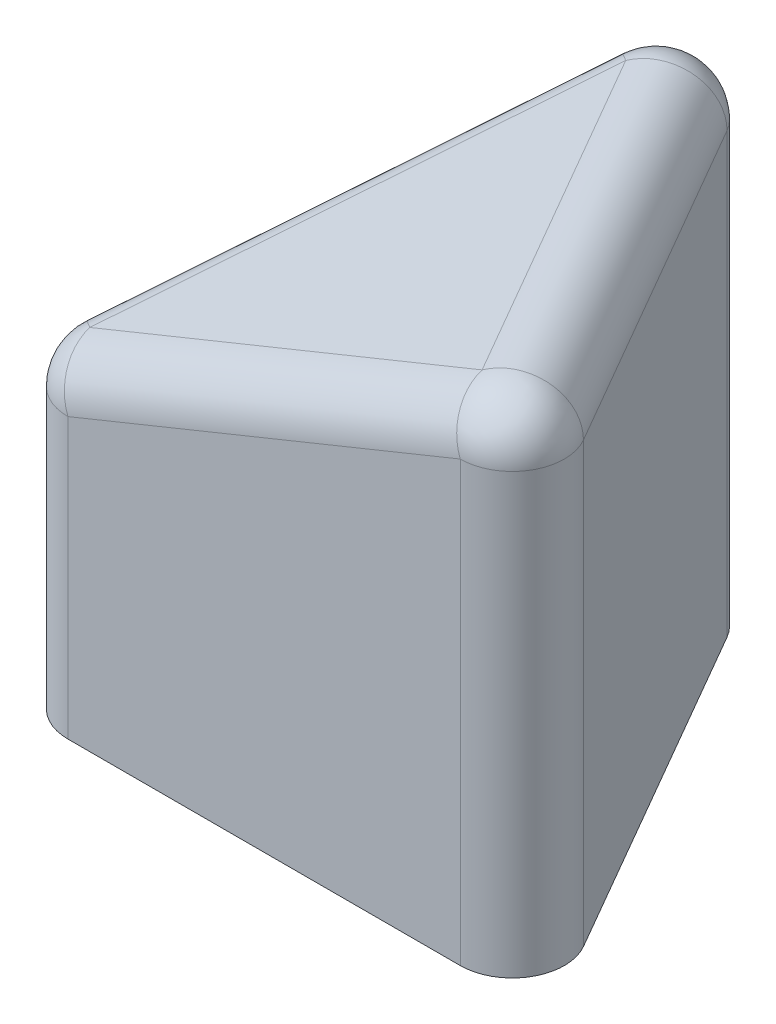
ISO-10303-21;
HEADER;
FILE_DESCRIPTION(('STEP AP214'),'2;1');
FILE_NAME('part.step','',(''),(''),'','','');
FILE_SCHEMA(('AUTOMOTIVE_DESIGN { 1 0 10303 214 1 1 1 1 }'));
ENDSEC;
DATA;
#1=APPLICATION_CONTEXT('core data for automotive mechanical design processes');
#2=APPLICATION_PROTOCOL_DEFINITION('international standard','automotive_design',2000,#1);
#3=PRODUCT_CONTEXT('',#1,'mechanical');
#4=PRODUCT('Part','Part','',(#3));
#5=PRODUCT_RELATED_PRODUCT_CATEGORY('part','',(#4));
#6=PRODUCT_DEFINITION_FORMATION('','',#4);
#7=PRODUCT_DEFINITION_CONTEXT('part definition',#1,'design');
#8=PRODUCT_DEFINITION('design','',#6,#7);
#9=PRODUCT_DEFINITION_SHAPE('','',#8);
#10=(LENGTH_UNIT() NAMED_UNIT(*) SI_UNIT(.MILLI.,.METRE.));
#11=(NAMED_UNIT(*) PLANE_ANGLE_UNIT() SI_UNIT($,.RADIAN.));
#12=(NAMED_UNIT(*) SI_UNIT($,.STERADIAN.) SOLID_ANGLE_UNIT());
#13=UNCERTAINTY_MEASURE_WITH_UNIT(LENGTH_MEASURE(1.E-05),#10,'distance_accuracy_value','');
#14=(GEOMETRIC_REPRESENTATION_CONTEXT(3) GLOBAL_UNCERTAINTY_ASSIGNED_CONTEXT((#13)) GLOBAL_UNIT_ASSIGNED_CONTEXT((#10,
#11,#12)) REPRESENTATION_CONTEXT('',''));
#15=CARTESIAN_POINT('',(0.,0.,0.));
#16=DIRECTION('',(0.,0.,1.));
#17=DIRECTION('',(1.,0.,0.));
#18=AXIS2_PLACEMENT_3D('',#15,#16,#17);
#19=CARTESIAN_POINT('',(9.26794919243112,10.,-1.));
#20=DIRECTION('',(0.,-1.,0.));
#21=DIRECTION('',(0.,0.,-1.));
#22=AXIS2_PLACEMENT_3D('',#19,#20,#21);
#23=CYLINDRICAL_SURFACE('',#22,1.);
#24=DIRECTION('',(0.,-1.,0.));
#25=VECTOR('',#24,1.);
#26=CARTESIAN_POINT('',(10.1339745962156,10.,-1.50000000000001));
#27=LINE('',#26,#25);
#28=CARTESIAN_POINT('',(10.1339745962156,8.4262852298518,-1.50000000000001));
#29=VERTEX_POINT('',#28);
#30=CARTESIAN_POINT('',(10.1339745962156,0.,-1.50000000000001));
#31=VERTEX_POINT('',#30);
#32=EDGE_CURVE('E95',#29,#31,#27,.T.);
#33=ORIENTED_EDGE('',*,*,#32,.F.);
#34=CARTESIAN_POINT('',(9.26794919243112,8.4262852298518,-1.));
#35=DIRECTION('',(0.,-1.,0.));
#36=DIRECTION('',(0.,0.,-1.));
#37=AXIS2_PLACEMENT_3D('',#34,#35,#36);
#38=CIRCLE('',#37,1.);
#39=CARTESIAN_POINT('',(9.26794919243111,8.4262852298518,0.));
#40=VERTEX_POINT('',#39);
#41=EDGE_CURVE('E152',#29,#40,#38,.T.);
#42=ORIENTED_EDGE('',*,*,#41,.T.);
#43=DIRECTION('',(0.,-1.,0.));
#44=VECTOR('',#43,1.);
#45=CARTESIAN_POINT('',(9.26794919243111,10.,0.));
#46=LINE('',#45,#44);
#47=CARTESIAN_POINT('',(9.26794919243111,0.,0.));
#48=VERTEX_POINT('',#47);
#49=EDGE_CURVE('E118',#40,#48,#46,.T.);
#50=ORIENTED_EDGE('',*,*,#49,.T.);
#51=CARTESIAN_POINT('',(9.26794919243112,0.,-1.));
#52=DIRECTION('',(0.,1.,0.));
#53=DIRECTION('',(0.,0.,1.));
#54=AXIS2_PLACEMENT_3D('',#51,#52,#53);
#55=CIRCLE('',#54,1.);
#56=EDGE_CURVE('E112',#48,#31,#55,.T.);
#57=ORIENTED_EDGE('',*,*,#56,.T.);
#58=EDGE_LOOP('',(#33,#42,#50,#57));
#59=FACE_BOUND('',#58,.T.);
#60=ADVANCED_FACE('F33',(#59),#23,.T.);
#61=CARTESIAN_POINT('',(10.1339745962156,10.,-1.50000000000001));
#62=DIRECTION('',(-0.866025403784439,0.,0.5));
#63=DIRECTION('',(0.5,0.,0.866025403784439));
#64=AXIS2_PLACEMENT_3D('',#61,#62,#63);
#65=PLANE('',#64);
#66=DIRECTION('',(0.,-1.,0.));
#67=VECTOR('',#66,1.);
#68=CARTESIAN_POINT('',(6.36602540378444,10.,-8.02627944162881));
#69=LINE('',#68,#67);
#70=CARTESIAN_POINT('',(6.36602540378444,8.4262852298518,-8.02627944162881));
#71=VERTEX_POINT('',#70);
#72=CARTESIAN_POINT('',(6.36602540378444,0.,-8.02627944162881));
#73=VERTEX_POINT('',#72);
#74=EDGE_CURVE('E106',#71,#73,#69,.T.);
#75=ORIENTED_EDGE('',*,*,#74,.F.);
#76=DIRECTION('',(-0.5,0.,-0.866025403784439));
#77=VECTOR('',#76,1.);
#78=CARTESIAN_POINT('',(10.1339745962156,8.4262852298518,-1.50000000000001));
#79=LINE('',#78,#77);
#80=EDGE_CURVE('E101',#71,#29,#79,.F.);
#81=ORIENTED_EDGE('',*,*,#80,.T.);
#82=ORIENTED_EDGE('',*,*,#32,.T.);
#83=DIRECTION('',(-0.5,0.,-0.866025403784438));
#84=VECTOR('',#83,1.);
#85=CARTESIAN_POINT('',(10.1339745962156,0.,-1.50000000000001));
#86=LINE('',#85,#84);
#87=EDGE_CURVE('E98',#31,#73,#86,.T.);
#88=ORIENTED_EDGE('',*,*,#87,.T.);
#89=EDGE_LOOP('',(#75,#81,#82,#88));
#90=FACE_BOUND('',#89,.T.);
#91=ADVANCED_FACE('F97',(#90),#65,.F.);
#92=CARTESIAN_POINT('',(5.5,10.,-7.52627944162882));
#93=DIRECTION('',(0.,-1.,0.));
#94=DIRECTION('',(0.,0.,-1.));
#95=AXIS2_PLACEMENT_3D('',#92,#93,#94);
#96=CYLINDRICAL_SURFACE('',#95,1.);
#97=DIRECTION('',(0.,-1.,0.));
#98=VECTOR('',#97,1.);
#99=CARTESIAN_POINT('',(4.63397459621556,10.,-8.02627944162881));
#100=LINE('',#99,#98);
#101=CARTESIAN_POINT('',(4.63397459621556,8.42628522985179,-8.02627944162881));
#102=VERTEX_POINT('',#101);
#103=CARTESIAN_POINT('',(4.63397459621556,0.,-8.02627944162881));
#104=VERTEX_POINT('',#103);
#105=EDGE_CURVE('E138',#102,#104,#100,.T.);
#106=ORIENTED_EDGE('',*,*,#105,.F.);
#107=CARTESIAN_POINT('',(5.5,8.4262852298518,-7.52627944162882));
#108=DIRECTION('',(0.,-1.,0.));
#109=DIRECTION('',(0.,0.,-1.));
#110=AXIS2_PLACEMENT_3D('',#107,#108,#109);
#111=CIRCLE('',#110,1.);
#112=EDGE_CURVE('E42',#102,#71,#111,.T.);
#113=ORIENTED_EDGE('',*,*,#112,.T.);
#114=ORIENTED_EDGE('',*,*,#74,.T.);
#115=CARTESIAN_POINT('',(5.5,0.,-7.52627944162882));
#116=DIRECTION('',(0.,1.,0.));
#117=DIRECTION('',(0.,0.,1.));
#118=AXIS2_PLACEMENT_3D('',#115,#116,#117);
#119=CIRCLE('',#118,1.);
#120=EDGE_CURVE('E115',#73,#104,#119,.T.);
#121=ORIENTED_EDGE('',*,*,#120,.T.);
#122=EDGE_LOOP('',(#106,#113,#114,#121));
#123=FACE_BOUND('',#122,.T.);
#124=ADVANCED_FACE('F187',(#123),#96,.T.);
#125=CARTESIAN_POINT('',(4.63397459621556,10.,-8.02627944162881));
#126=DIRECTION('',(0.866025403784439,0.,0.5));
#127=DIRECTION('',(0.5,0.,-0.866025403784439));
#128=AXIS2_PLACEMENT_3D('',#125,#126,#127);
#129=PLANE('',#128);
#130=DIRECTION('',(0.,-1.,0.));
#131=VECTOR('',#130,1.);
#132=CARTESIAN_POINT('',(0.866025403784446,10.,-1.50000000000001));
#133=LINE('',#132,#131);
#134=CARTESIAN_POINT('',(0.866025403784446,5.36456083467666,-1.50000000000001));
#135=VERTEX_POINT('',#134);
#136=CARTESIAN_POINT('',(0.866025403784446,0.,-1.50000000000001));
#137=VERTEX_POINT('',#136);
#138=EDGE_CURVE('E136',#135,#137,#133,.T.);
#139=ORIENTED_EDGE('',*,*,#138,.F.);
#140=DIRECTION('',(0.463227593724074,0.37640508186051,-0.80233372779797));
#141=VECTOR('',#140,1.);
#142=CARTESIAN_POINT('',(4.908369423999,8.64925037487606,-8.50154522468386));
#143=LINE('',#142,#141);
#144=EDGE_CURVE('E11',#135,#102,#143,.T.);
#145=ORIENTED_EDGE('',*,*,#144,.T.);
#146=ORIENTED_EDGE('',*,*,#105,.T.);
#147=DIRECTION('',(-0.5,0.,0.866025403784438));
#148=VECTOR('',#147,1.);
#149=CARTESIAN_POINT('',(4.63397459621556,0.,-8.02627944162881));
#150=LINE('',#149,#148);
#151=EDGE_CURVE('E125',#104,#137,#150,.T.);
#152=ORIENTED_EDGE('',*,*,#151,.T.);
#153=EDGE_LOOP('',(#139,#145,#146,#152));
#154=FACE_BOUND('',#153,.T.);
#155=ADVANCED_FACE('F186',(#154),#129,.F.);
#156=CARTESIAN_POINT('',(1.73205080756888,10.,-1.));
#157=DIRECTION('',(0.,-1.,0.));
#158=DIRECTION('',(0.,0.,-1.));
#159=AXIS2_PLACEMENT_3D('',#156,#157,#158);
#160=CYLINDRICAL_SURFACE('',#159,1.);
#161=DIRECTION('',(0.,-1.,0.));
#162=VECTOR('',#161,1.);
#163=CARTESIAN_POINT('',(1.73205080756889,10.,0.));
#164=LINE('',#163,#162);
#165=CARTESIAN_POINT('',(1.73205080756889,5.36456083467666,0.));
#166=VERTEX_POINT('',#165);
#167=CARTESIAN_POINT('',(1.73205080756889,0.,0.));
#168=VERTEX_POINT('',#167);
#169=EDGE_CURVE('E134',#166,#168,#164,.T.);
#170=ORIENTED_EDGE('',*,*,#169,.F.);
#171=CARTESIAN_POINT('',(1.73205080756888,5.36456083467665,-1.));
#172=DIRECTION('',(0.,-1.,0.));
#173=DIRECTION('',(0.,0.,-1.));
#174=AXIS2_PLACEMENT_3D('',#171,#172,#173);
#175=CIRCLE('',#174,1.);
#176=EDGE_CURVE('E105',#166,#135,#175,.T.);
#177=ORIENTED_EDGE('',*,*,#176,.T.);
#178=ORIENTED_EDGE('',*,*,#138,.T.);
#179=CARTESIAN_POINT('',(1.73205080756888,0.,-1.));
#180=DIRECTION('',(0.,1.,0.));
#181=DIRECTION('',(0.,0.,1.));
#182=AXIS2_PLACEMENT_3D('',#179,#180,#181);
#183=CIRCLE('',#182,1.);
#184=EDGE_CURVE('E128',#137,#168,#183,.T.);
#185=ORIENTED_EDGE('',*,*,#184,.T.);
#186=EDGE_LOOP('',(#170,#177,#178,#185));
#187=FACE_BOUND('',#186,.T.);
#188=ADVANCED_FACE('F183',(#187),#160,.T.);
#189=CARTESIAN_POINT('',(1.73205080756889,10.,0.));
#190=DIRECTION('',(0.,0.,-1.));
#191=DIRECTION('',(-1.,0.,0.));
#192=AXIS2_PLACEMENT_3D('',#189,#190,#191);
#193=PLANE('',#192);
#194=ORIENTED_EDGE('',*,*,#49,.F.);
#195=DIRECTION('',(-0.926455187448148,-0.37640508186051,0.));
#196=VECTOR('',#195,1.);
#197=CARTESIAN_POINT('',(3.34853246688477,6.02131349745438,0.));
#198=LINE('',#197,#196);
#199=EDGE_CURVE('E143',#40,#166,#198,.T.);
#200=ORIENTED_EDGE('',*,*,#199,.T.);
#201=ORIENTED_EDGE('',*,*,#169,.T.);
#202=DIRECTION('',(1.,0.,0.));
#203=VECTOR('',#202,1.);
#204=CARTESIAN_POINT('',(1.73205080756889,0.,0.));
#205=LINE('',#204,#203);
#206=EDGE_CURVE('E131',#168,#48,#205,.T.);
#207=ORIENTED_EDGE('',*,*,#206,.T.);
#208=EDGE_LOOP('',(#194,#200,#201,#207));
#209=FACE_BOUND('',#208,.T.);
#210=ADVANCED_FACE('F179',(#209),#193,.F.);
#211=CARTESIAN_POINT('',(9.26794919243112,0.,-1.));
#212=DIRECTION('',(0.,1.,0.));
#213=DIRECTION('',(0.,0.,1.));
#214=AXIS2_PLACEMENT_3D('',#211,#212,#213);
#215=PLANE('',#214);
#216=ORIENTED_EDGE('',*,*,#56,.F.);
#217=ORIENTED_EDGE('',*,*,#206,.F.);
#218=ORIENTED_EDGE('',*,*,#184,.F.);
#219=ORIENTED_EDGE('',*,*,#151,.F.);
#220=ORIENTED_EDGE('',*,*,#120,.F.);
#221=ORIENTED_EDGE('',*,*,#87,.F.);
#222=EDGE_LOOP('',(#216,#217,#218,#219,#220,#221));
#223=FACE_BOUND('',#222,.T.);
#224=ADVANCED_FACE('F110',(#223),#215,.F.);
#225=CARTESIAN_POINT('',(16.75,10.,9.95929214352105));
#226=DIRECTION('',(0.367819777735899,-0.905323964929177,-0.212360847689089));
#227=DIRECTION('',(0.926455187448148,0.37640508186051,0.));
#228=AXIS2_PLACEMENT_3D('',#225,#226,#227);
#229=PLANE('',#228);
#230=DIRECTION('',(0.463227593724074,0.37640508186051,-0.80233372779797));
#231=VECTOR('',#230,1.);
#232=CARTESIAN_POINT('',(1.32185571351418,6.23545186723319,-0.714242951459956));
#233=LINE('',#232,#231);
#234=CARTESIAN_POINT('',(5.1321802222641,9.33160919478097,-7.31391859393974));
#235=VERTEX_POINT('',#234);
#236=CARTESIAN_POINT('',(1.36423102983298,6.26988479960583,-0.787639152310912));
#237=VERTEX_POINT('',#236);
#238=EDGE_CURVE('E145',#235,#237,#233,.F.);
#239=ORIENTED_EDGE('',*,*,#238,.T.);
#240=DIRECTION('',(-0.926455187448148,-0.37640508186051,0.));
#241=VECTOR('',#240,1.);
#242=CARTESIAN_POINT('',(15.8709070411383,12.1637333586489,-0.787639152310914));
#243=LINE('',#242,#241);
#244=CARTESIAN_POINT('',(8.90012941469522,9.33160919478097,-0.787639152310911));
#245=VERTEX_POINT('',#244);
#246=EDGE_CURVE('E149',#237,#245,#243,.F.);
#247=ORIENTED_EDGE('',*,*,#246,.T.);
#248=DIRECTION('',(-0.5,0.,-0.866025403784439));
#249=VECTOR('',#248,1.);
#250=CARTESIAN_POINT('',(15.5161548184797,9.33160919478097,10.6716529912101));
#251=LINE('',#250,#249);
#252=EDGE_CURVE('E147',#245,#235,#251,.T.);
#253=ORIENTED_EDGE('',*,*,#252,.T.);
#254=EDGE_LOOP('',(#239,#247,#253));
#255=FACE_BOUND('',#254,.T.);
#256=ADVANCED_FACE('F219',(#255),#229,.F.);
#257=CARTESIAN_POINT('',(15.8839745962156,8.4262852298518,10.459292143521));
#258=DIRECTION('',(-0.5,0.,-0.866025403784439));
#259=DIRECTION('',(-0.866025403784439,0.,0.5));
#260=AXIS2_PLACEMENT_3D('',#257,#258,#259);
#261=CYLINDRICAL_SURFACE('',#260,1.);
#262=CARTESIAN_POINT('',(9.26794919243111,8.4262852298518,-1.00000000000001));
#263=DIRECTION('',(0.5,0.,0.866025403784439));
#264=DIRECTION('',(0.866025403784439,0.,-0.5));
#265=AXIS2_PLACEMENT_3D('',#262,#263,#264);
#266=CIRCLE('',#265,1.);
#267=EDGE_CURVE('E37',#29,#245,#266,.T.);
#268=ORIENTED_EDGE('',*,*,#267,.F.);
#269=ORIENTED_EDGE('',*,*,#80,.F.);
#270=CARTESIAN_POINT('',(5.50000000000001,8.4262852298518,-7.52627944162881));
#271=DIRECTION('',(-0.5,0.,-0.866025403784438));
#272=DIRECTION('',(-0.866025403784438,0.,0.5));
#273=AXIS2_PLACEMENT_3D('',#270,#271,#272);
#274=CIRCLE('',#273,1.);
#275=EDGE_CURVE('E122',#235,#71,#274,.T.);
#276=ORIENTED_EDGE('',*,*,#275,.F.);
#277=ORIENTED_EDGE('',*,*,#252,.F.);
#278=EDGE_LOOP('',(#268,#269,#276,#277));
#279=FACE_BOUND('',#278,.T.);
#280=ADVANCED_FACE('F35',(#279),#261,.T.);
#281=CARTESIAN_POINT('',(9.26794919243112,8.4262852298518,-1.));
#282=DIRECTION('',(0.,0.,1.));
#283=DIRECTION('',(1.,0.,0.));
#284=AXIS2_PLACEMENT_3D('',#281,#282,#283);
#285=SPHERICAL_SURFACE('',#284,1.);
#286=ORIENTED_EDGE('',*,*,#41,.F.);
#287=ORIENTED_EDGE('',*,*,#267,.T.);
#288=CARTESIAN_POINT('',(9.26794919243112,8.4262852298518,-1.));
#289=DIRECTION('',(-0.926455187448149,-0.376405081860507,0.));
#290=DIRECTION('',(0.376405081860507,-0.926455187448149,0.));
#291=AXIS2_PLACEMENT_3D('',#288,#289,#290);
#292=CIRCLE('',#291,1.);
#293=EDGE_CURVE('E164',#40,#245,#292,.T.);
#294=ORIENTED_EDGE('',*,*,#293,.F.);
#295=EDGE_LOOP('',(#286,#287,#294));
#296=FACE_BOUND('',#295,.T.);
#297=ADVANCED_FACE('F176',(#296),#285,.T.);
#298=CARTESIAN_POINT('',(5.5,8.4262852298518,-7.52627944162882));
#299=DIRECTION('',(0.,0.,1.));
#300=DIRECTION('',(1.,0.,0.));
#301=AXIS2_PLACEMENT_3D('',#298,#299,#300);
#302=SPHERICAL_SURFACE('',#301,1.);
#303=ORIENTED_EDGE('',*,*,#275,.T.);
#304=ORIENTED_EDGE('',*,*,#112,.F.);
#305=CARTESIAN_POINT('',(5.5,8.4262852298518,-7.52627944162882));
#306=DIRECTION('',(-0.463227593724065,-0.376405081860507,0.802333727797977));
#307=DIRECTION('',(0.866025403784445,0.,0.49999999999999));
#308=AXIS2_PLACEMENT_3D('',#305,#306,#307);
#309=CIRCLE('',#308,1.);
#310=EDGE_CURVE('E161',#235,#102,#309,.T.);
#311=ORIENTED_EDGE('',*,*,#310,.F.);
#312=EDGE_LOOP('',(#303,#304,#311));
#313=FACE_BOUND('',#312,.T.);
#314=ADVANCED_FACE('F169',(#313),#302,.T.);
#315=CARTESIAN_POINT('',(3.34853246688477,6.02131349745438,-1.));
#316=DIRECTION('',(-0.926455187448148,-0.37640508186051,0.));
#317=DIRECTION('',(0.37640508186051,-0.926455187448148,0.));
#318=AXIS2_PLACEMENT_3D('',#315,#316,#317);
#319=CYLINDRICAL_SURFACE('',#318,1.);
#320=ORIENTED_EDGE('',*,*,#293,.T.);
#321=ORIENTED_EDGE('',*,*,#246,.F.);
#322=CARTESIAN_POINT('',(1.73205080756889,5.36456083467666,-1.));
#323=DIRECTION('',(-0.926455187448143,-0.376405081860522,0.));
#324=DIRECTION('',(0.376405081860522,-0.926455187448143,0.));
#325=AXIS2_PLACEMENT_3D('',#322,#323,#324);
#326=CIRCLE('',#325,1.);
#327=EDGE_CURVE('E158',#166,#237,#326,.T.);
#328=ORIENTED_EDGE('',*,*,#327,.F.);
#329=ORIENTED_EDGE('',*,*,#199,.F.);
#330=EDGE_LOOP('',(#320,#321,#328,#329));
#331=FACE_BOUND('',#330,.T.);
#332=ADVANCED_FACE('F209',(#331),#319,.T.);
#333=CARTESIAN_POINT('',(5.77439482778344,8.64925037487606,-8.00154522468386));
#334=DIRECTION('',(0.463227593724074,0.37640508186051,-0.80233372779797));
#335=DIRECTION('',(-0.866025403784439,0.,-0.5));
#336=AXIS2_PLACEMENT_3D('',#333,#334,#335);
#337=CYLINDRICAL_SURFACE('',#336,1.);
#338=ORIENTED_EDGE('',*,*,#310,.T.);
#339=ORIENTED_EDGE('',*,*,#144,.F.);
#340=CARTESIAN_POINT('',(1.73205080756888,5.36456083467665,-1.));
#341=DIRECTION('',(-0.463227593724084,-0.376405081860512,0.802333727797963));
#342=DIRECTION('',(0.866025403784432,0.,0.500000000000012));
#343=AXIS2_PLACEMENT_3D('',#340,#341,#342);
#344=CIRCLE('',#343,1.);
#345=EDGE_CURVE('E156',#237,#135,#344,.T.);
#346=ORIENTED_EDGE('',*,*,#345,.F.);
#347=ORIENTED_EDGE('',*,*,#238,.F.);
#348=EDGE_LOOP('',(#338,#339,#346,#347));
#349=FACE_BOUND('',#348,.T.);
#350=ADVANCED_FACE('F205',(#349),#337,.T.);
#351=CARTESIAN_POINT('',(1.73205080756888,5.36456083467665,-1.));
#352=DIRECTION('',(0.,0.,1.));
#353=DIRECTION('',(1.,0.,0.));
#354=AXIS2_PLACEMENT_3D('',#351,#352,#353);
#355=SPHERICAL_SURFACE('',#354,1.);
#356=ORIENTED_EDGE('',*,*,#176,.F.);
#357=ORIENTED_EDGE('',*,*,#327,.T.);
#358=ORIENTED_EDGE('',*,*,#345,.T.);
#359=EDGE_LOOP('',(#356,#357,#358));
#360=FACE_BOUND('',#359,.T.);
#361=ADVANCED_FACE('F202',(#360),#355,.T.);
#362=CLOSED_SHELL('',(#60,#91,#124,#155,#188,#210,#224,#256,#280,#297,#314,#332,#350,#361));
#363=MANIFOLD_SOLID_BREP('B2',#362);
#364=ADVANCED_BREP_SHAPE_REPRESENTATION('',(#18,#363),#14);
#365=SHAPE_DEFINITION_REPRESENTATION(#9,#364);
ENDSEC;
END-ISO-10303-21;
